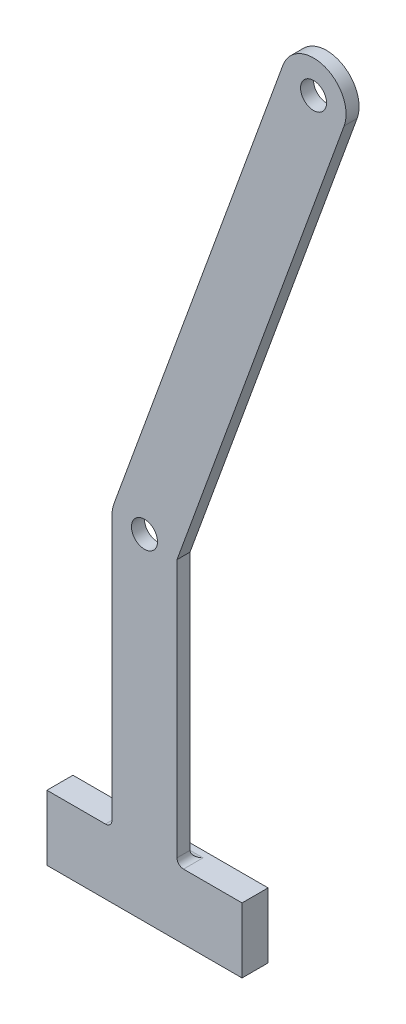
ISO-10303-21;
HEADER;
FILE_DESCRIPTION(('STEP AP214'),'2;1');
FILE_NAME('part.step','',(''),(''),'','','');
FILE_SCHEMA(('AUTOMOTIVE_DESIGN { 1 0 10303 214 1 1 1 1 }'));
ENDSEC;
DATA;
#1=APPLICATION_CONTEXT('core data for automotive mechanical design processes');
#2=APPLICATION_PROTOCOL_DEFINITION('international standard','automotive_design',2000,#1);
#3=PRODUCT_CONTEXT('',#1,'mechanical');
#4=PRODUCT('Part','Part','',(#3));
#5=PRODUCT_RELATED_PRODUCT_CATEGORY('part','',(#4));
#6=PRODUCT_DEFINITION_FORMATION('','',#4);
#7=PRODUCT_DEFINITION_CONTEXT('part definition',#1,'design');
#8=PRODUCT_DEFINITION('design','',#6,#7);
#9=PRODUCT_DEFINITION_SHAPE('','',#8);
#10=(LENGTH_UNIT() NAMED_UNIT(*) SI_UNIT(.MILLI.,.METRE.));
#11=(NAMED_UNIT(*) PLANE_ANGLE_UNIT() SI_UNIT($,.RADIAN.));
#12=(NAMED_UNIT(*) SI_UNIT($,.STERADIAN.) SOLID_ANGLE_UNIT());
#13=UNCERTAINTY_MEASURE_WITH_UNIT(LENGTH_MEASURE(1.E-05),#10,'distance_accuracy_value','');
#14=(GEOMETRIC_REPRESENTATION_CONTEXT(3) GLOBAL_UNCERTAINTY_ASSIGNED_CONTEXT((#13)) GLOBAL_UNIT_ASSIGNED_CONTEXT((#10,
#11,#12)) REPRESENTATION_CONTEXT('',''));
#15=CARTESIAN_POINT('',(0.,0.,0.));
#16=DIRECTION('',(0.,0.,1.));
#17=DIRECTION('',(1.,0.,0.));
#18=AXIS2_PLACEMENT_3D('',#15,#16,#17);
#19=CARTESIAN_POINT('',(0.,0.,0.));
#20=DIRECTION('',(0.,0.,1.));
#21=DIRECTION('',(1.,0.,0.));
#22=AXIS2_PLACEMENT_3D('',#19,#20,#21);
#23=PLANE('',#22);
#24=CARTESIAN_POINT('',(-60.9517842337936,-109.749131758256,0.));
#25=DIRECTION('',(0.,0.,1.));
#26=DIRECTION('',(1.,0.,0.));
#27=AXIS2_PLACEMENT_3D('',#24,#25,#26);
#28=CIRCLE('',#27,2.54);
#29=CARTESIAN_POINT('',(-58.4117842337936,-109.749131758256,0.));
#30=VERTEX_POINT('',#29);
#31=EDGE_CURVE('E175',#30,#30,#28,.T.);
#32=ORIENTED_EDGE('',*,*,#31,.T.);
#33=EDGE_LOOP('',(#32));
#34=FACE_BOUND('',#33,.T.);
#35=CARTESIAN_POINT('',(-27.94,-19.0499999999999,0.));
#36=DIRECTION('',(0.,0.,1.));
#37=DIRECTION('',(1.,0.,0.));
#38=AXIS2_PLACEMENT_3D('',#35,#36,#37);
#39=CIRCLE('',#38,2.54000000000001);
#40=CARTESIAN_POINT('',(-25.4,-19.0499999999999,0.));
#41=VERTEX_POINT('',#40);
#42=EDGE_CURVE('E216',#41,#41,#39,.T.);
#43=ORIENTED_EDGE('',*,*,#42,.T.);
#44=EDGE_LOOP('',(#43));
#45=FACE_BOUND('',#44,.T.);
#46=DIRECTION('',(0.,-1.,0.));
#47=VECTOR('',#46,1.);
#48=CARTESIAN_POINT('',(-54.6017842337937,0.,0.));
#49=LINE('',#48,#47);
#50=CARTESIAN_POINT('',(-54.6017842337936,-110.868808085755,0.));
#51=VERTEX_POINT('',#50);
#52=CARTESIAN_POINT('',(-54.6017842337936,-161.29,0.));
#53=VERTEX_POINT('',#52);
#54=EDGE_CURVE('E208',#51,#53,#49,.T.);
#55=ORIENTED_EDGE('',*,*,#54,.T.);
#56=DIRECTION('',(1.,0.,0.));
#57=VECTOR('',#56,1.);
#58=CARTESIAN_POINT('',(-67.3017842337935,-161.29,0.));
#59=LINE('',#58,#57);
#60=CARTESIAN_POINT('',(-67.3017842337936,-161.29,0.));
#61=VERTEX_POINT('',#60);
#62=EDGE_CURVE('E244',#53,#61,#59,.F.);
#63=ORIENTED_EDGE('',*,*,#62,.T.);
#64=DIRECTION('',(0.,-1.,0.));
#65=VECTOR('',#64,1.);
#66=CARTESIAN_POINT('',(-67.3017842337936,0.,0.));
#67=LINE('',#66,#65);
#68=CARTESIAN_POINT('',(-67.3017842337936,-109.749131758256,0.));
#69=VERTEX_POINT('',#68);
#70=EDGE_CURVE('E206',#69,#61,#67,.T.);
#71=ORIENTED_EDGE('',*,*,#70,.F.);
#72=CARTESIAN_POINT('',(-60.9517842337936,-109.749131758256,0.));
#73=DIRECTION('',(0.,0.,1.));
#74=DIRECTION('',(1.,0.,0.));
#75=AXIS2_PLACEMENT_3D('',#72,#73,#74);
#76=CIRCLE('',#75,6.35);
#77=CARTESIAN_POINT('',(-66.918832375784,-107.577303848138,0.));
#78=VERTEX_POINT('',#77);
#79=EDGE_CURVE('E204',#78,#69,#76,.T.);
#80=ORIENTED_EDGE('',*,*,#79,.F.);
#81=DIRECTION('',(-0.342020143325669,-0.939692620785908,0.));
#82=VECTOR('',#81,1.);
#83=CARTESIAN_POINT('',(-24.5161370300983,8.92314413814722,0.));
#84=LINE('',#83,#82);
#85=CARTESIAN_POINT('',(-33.9070481419905,-16.878172089882,0.));
#86=VERTEX_POINT('',#85);
#87=EDGE_CURVE('E170',#86,#78,#84,.T.);
#88=ORIENTED_EDGE('',*,*,#87,.F.);
#89=CARTESIAN_POINT('',(-27.94,-19.0499999999999,0.));
#90=DIRECTION('',(0.,0.,1.));
#91=DIRECTION('',(1.,0.,0.));
#92=AXIS2_PLACEMENT_3D('',#89,#90,#91);
#93=CIRCLE('',#92,6.35);
#94=CARTESIAN_POINT('',(-21.9729518580095,-21.221827910118,0.));
#95=VERTEX_POINT('',#94);
#96=EDGE_CURVE('E214',#95,#86,#93,.T.);
#97=ORIENTED_EDGE('',*,*,#96,.F.);
#98=DIRECTION('',(-0.342020143325669,-0.939692620785908,0.));
#99=VECTOR('',#98,1.);
#100=CARTESIAN_POINT('',(-12.5820407461173,4.57948831791122,0.));
#101=LINE('',#100,#99);
#102=EDGE_CURVE('E211',#95,#51,#101,.T.);
#103=ORIENTED_EDGE('',*,*,#102,.T.);
#104=EDGE_LOOP('',(#55,#63,#71,#80,#88,#97,#103));
#105=FACE_BOUND('',#104,.T.);
#106=ADVANCED_FACE('F39',(#34,#45,#105),#23,.F.);
#107=CARTESIAN_POINT('',(-24.5161370300983,8.92314413814722,2.54));
#108=DIRECTION('',(0.939692620785908,-0.342020143325669,0.));
#109=DIRECTION('',(0.342020143325669,0.939692620785908,0.));
#110=AXIS2_PLACEMENT_3D('',#107,#108,#109);
#111=PLANE('',#110);
#112=ORIENTED_EDGE('',*,*,#87,.T.);
#113=DIRECTION('',(0.,0.,-1.));
#114=VECTOR('',#113,1.);
#115=CARTESIAN_POINT('',(-66.918832375784,-107.577303848138,2.54));
#116=LINE('',#115,#114);
#117=CARTESIAN_POINT('',(-66.918832375784,-107.577303848138,2.54));
#118=VERTEX_POINT('',#117);
#119=EDGE_CURVE('E234',#118,#78,#116,.T.);
#120=ORIENTED_EDGE('',*,*,#119,.F.);
#121=DIRECTION('',(-0.342020143325669,-0.939692620785908,0.));
#122=VECTOR('',#121,1.);
#123=CARTESIAN_POINT('',(-24.5161370300983,8.92314413814722,2.54));
#124=LINE('',#123,#122);
#125=CARTESIAN_POINT('',(-33.9070481419905,-16.878172089882,2.54));
#126=VERTEX_POINT('',#125);
#127=EDGE_CURVE('E171',#126,#118,#124,.T.);
#128=ORIENTED_EDGE('',*,*,#127,.F.);
#129=DIRECTION('',(0.,0.,-1.));
#130=VECTOR('',#129,1.);
#131=CARTESIAN_POINT('',(-33.9070481419905,-16.878172089882,2.54));
#132=LINE('',#131,#130);
#133=EDGE_CURVE('E201',#126,#86,#132,.T.);
#134=ORIENTED_EDGE('',*,*,#133,.T.);
#135=EDGE_LOOP('',(#112,#120,#128,#134));
#136=FACE_BOUND('',#135,.T.);
#137=ADVANCED_FACE('F290',(#136),#111,.F.);
#138=CARTESIAN_POINT('',(-60.9517842337936,-109.749131758256,2.54));
#139=DIRECTION('',(0.,0.,-1.));
#140=DIRECTION('',(-1.,0.,0.));
#141=AXIS2_PLACEMENT_3D('',#138,#139,#140);
#142=CYLINDRICAL_SURFACE('',#141,6.35);
#143=ORIENTED_EDGE('',*,*,#79,.T.);
#144=DIRECTION('',(0.,0.,-1.));
#145=VECTOR('',#144,1.);
#146=CARTESIAN_POINT('',(-67.3017842337936,-109.749131758256,2.54));
#147=LINE('',#146,#145);
#148=CARTESIAN_POINT('',(-67.3017842337936,-109.749131758256,2.54));
#149=VERTEX_POINT('',#148);
#150=EDGE_CURVE('E231',#149,#69,#147,.T.);
#151=ORIENTED_EDGE('',*,*,#150,.F.);
#152=CARTESIAN_POINT('',(-60.9517842337936,-109.749131758256,2.54));
#153=DIRECTION('',(0.,0.,1.));
#154=DIRECTION('',(1.,0.,0.));
#155=AXIS2_PLACEMENT_3D('',#152,#153,#154);
#156=CIRCLE('',#155,6.35);
#157=EDGE_CURVE('E174',#118,#149,#156,.T.);
#158=ORIENTED_EDGE('',*,*,#157,.F.);
#159=ORIENTED_EDGE('',*,*,#119,.T.);
#160=EDGE_LOOP('',(#143,#151,#158,#159));
#161=FACE_BOUND('',#160,.T.);
#162=ADVANCED_FACE('F291',(#161),#142,.T.);
#163=CARTESIAN_POINT('',(-67.3017842337936,0.,2.54));
#164=DIRECTION('',(1.,0.,0.));
#165=DIRECTION('',(0.,0.,-1.));
#166=AXIS2_PLACEMENT_3D('',#163,#164,#165);
#167=PLANE('',#166);
#168=ORIENTED_EDGE('',*,*,#70,.T.);
#169=DIRECTION('',(0.,0.,-1.));
#170=VECTOR('',#169,1.);
#171=CARTESIAN_POINT('',(-67.3017842337936,-161.29,2.54));
#172=LINE('',#171,#170);
#173=CARTESIAN_POINT('',(-67.3017842337936,-161.29,2.54));
#174=VERTEX_POINT('',#173);
#175=EDGE_CURVE('E56',#61,#174,#172,.F.);
#176=ORIENTED_EDGE('',*,*,#175,.T.);
#177=DIRECTION('',(0.,-1.,0.));
#178=VECTOR('',#177,1.);
#179=CARTESIAN_POINT('',(-67.3017842337936,0.,2.54));
#180=LINE('',#179,#178);
#181=EDGE_CURVE('E177',#149,#174,#180,.T.);
#182=ORIENTED_EDGE('',*,*,#181,.F.);
#183=ORIENTED_EDGE('',*,*,#150,.T.);
#184=EDGE_LOOP('',(#168,#176,#182,#183));
#185=FACE_BOUND('',#184,.T.);
#186=ADVANCED_FACE('F270',(#185),#167,.F.);
#187=CARTESIAN_POINT('',(-80.0017842337936,0.,2.54));
#188=DIRECTION('',(1.,0.,0.));
#189=DIRECTION('',(0.,0.,-1.));
#190=AXIS2_PLACEMENT_3D('',#187,#188,#189);
#191=PLANE('',#190);
#192=DIRECTION('',(0.,0.,-1.));
#193=VECTOR('',#192,1.);
#194=CARTESIAN_POINT('',(-80.0017842337936,-162.56,2.54));
#195=LINE('',#194,#193);
#196=CARTESIAN_POINT('',(-80.0017842337936,-162.56,2.54));
#197=VERTEX_POINT('',#196);
#198=CARTESIAN_POINT('',(-80.0017842337936,-162.56,-2.54));
#199=VERTEX_POINT('',#198);
#200=EDGE_CURVE('E229',#197,#199,#195,.T.);
#201=ORIENTED_EDGE('',*,*,#200,.T.);
#202=DIRECTION('',(0.,1.,0.));
#203=VECTOR('',#202,1.);
#204=CARTESIAN_POINT('',(-80.0017842337936,-162.56,-2.54));
#205=LINE('',#204,#203);
#206=CARTESIAN_POINT('',(-80.0017842337936,-175.26,-2.54));
#207=VERTEX_POINT('',#206);
#208=EDGE_CURVE('E158',#207,#199,#205,.T.);
#209=ORIENTED_EDGE('',*,*,#208,.F.);
#210=DIRECTION('',(0.,0.,-1.));
#211=VECTOR('',#210,1.);
#212=CARTESIAN_POINT('',(-80.0017842337936,-175.26,2.54));
#213=LINE('',#212,#211);
#214=CARTESIAN_POINT('',(-80.0017842337936,-175.26,2.54));
#215=VERTEX_POINT('',#214);
#216=EDGE_CURVE('E148',#215,#207,#213,.T.);
#217=ORIENTED_EDGE('',*,*,#216,.F.);
#218=DIRECTION('',(0.,-1.,0.));
#219=VECTOR('',#218,1.);
#220=CARTESIAN_POINT('',(-80.0017842337936,0.,2.54));
#221=LINE('',#220,#219);
#222=EDGE_CURVE('E181',#197,#215,#221,.T.);
#223=ORIENTED_EDGE('',*,*,#222,.F.);
#224=EDGE_LOOP('',(#201,#209,#217,#223));
#225=FACE_BOUND('',#224,.T.);
#226=ADVANCED_FACE('F299',(#225),#191,.F.);
#227=CARTESIAN_POINT('',(0.,-175.26,2.54));
#228=DIRECTION('',(0.,1.,0.));
#229=DIRECTION('',(0.,0.,1.));
#230=AXIS2_PLACEMENT_3D('',#227,#228,#229);
#231=PLANE('',#230);
#232=ORIENTED_EDGE('',*,*,#216,.T.);
#233=DIRECTION('',(-1.,0.,0.));
#234=VECTOR('',#233,1.);
#235=CARTESIAN_POINT('',(-41.9017842337936,-175.26,-2.54));
#236=LINE('',#235,#234);
#237=CARTESIAN_POINT('',(-41.9017842337936,-175.26,-2.54));
#238=VERTEX_POINT('',#237);
#239=EDGE_CURVE('E152',#238,#207,#236,.T.);
#240=ORIENTED_EDGE('',*,*,#239,.F.);
#241=DIRECTION('',(0.,0.,-1.));
#242=VECTOR('',#241,1.);
#243=CARTESIAN_POINT('',(-41.9017842337936,-175.26,2.54));
#244=LINE('',#243,#242);
#245=CARTESIAN_POINT('',(-41.9017842337936,-175.26,2.54));
#246=VERTEX_POINT('',#245);
#247=EDGE_CURVE('E139',#246,#238,#244,.T.);
#248=ORIENTED_EDGE('',*,*,#247,.F.);
#249=DIRECTION('',(1.,0.,0.));
#250=VECTOR('',#249,1.);
#251=CARTESIAN_POINT('',(0.,-175.26,2.54));
#252=LINE('',#251,#250);
#253=EDGE_CURVE('E183',#215,#246,#252,.T.);
#254=ORIENTED_EDGE('',*,*,#253,.F.);
#255=EDGE_LOOP('',(#232,#240,#248,#254));
#256=FACE_BOUND('',#255,.T.);
#257=ADVANCED_FACE('F153',(#256),#231,.F.);
#258=CARTESIAN_POINT('',(-41.9017842337936,0.,2.54));
#259=DIRECTION('',(-1.,0.,0.));
#260=DIRECTION('',(0.,0.,1.));
#261=AXIS2_PLACEMENT_3D('',#258,#259,#260);
#262=PLANE('',#261);
#263=ORIENTED_EDGE('',*,*,#247,.T.);
#264=DIRECTION('',(0.,-1.,0.));
#265=VECTOR('',#264,1.);
#266=CARTESIAN_POINT('',(-41.9017842337936,-162.56,-2.54));
#267=LINE('',#266,#265);
#268=CARTESIAN_POINT('',(-41.9017842337936,-162.56,-2.54));
#269=VERTEX_POINT('',#268);
#270=EDGE_CURVE('E144',#269,#238,#267,.T.);
#271=ORIENTED_EDGE('',*,*,#270,.F.);
#272=DIRECTION('',(0.,0.,-1.));
#273=VECTOR('',#272,1.);
#274=CARTESIAN_POINT('',(-41.9017842337936,-162.56,2.54));
#275=LINE('',#274,#273);
#276=CARTESIAN_POINT('',(-41.9017842337936,-162.56,2.54));
#277=VERTEX_POINT('',#276);
#278=EDGE_CURVE('E149',#277,#269,#275,.T.);
#279=ORIENTED_EDGE('',*,*,#278,.F.);
#280=DIRECTION('',(0.,1.,0.));
#281=VECTOR('',#280,1.);
#282=CARTESIAN_POINT('',(-41.9017842337936,0.,2.54));
#283=LINE('',#282,#281);
#284=EDGE_CURVE('E145',#246,#277,#283,.T.);
#285=ORIENTED_EDGE('',*,*,#284,.F.);
#286=EDGE_LOOP('',(#263,#271,#279,#285));
#287=FACE_BOUND('',#286,.T.);
#288=ADVANCED_FACE('F141',(#287),#262,.F.);
#289=CARTESIAN_POINT('',(0.,-162.56,2.54));
#290=DIRECTION('',(0.,-1.,0.));
#291=DIRECTION('',(0.,0.,-1.));
#292=AXIS2_PLACEMENT_3D('',#289,#290,#291);
#293=PLANE('',#292);
#294=DIRECTION('',(1.,0.,0.));
#295=VECTOR('',#294,1.);
#296=CARTESIAN_POINT('',(-54.6017842337936,-162.56,-1.27));
#297=LINE('',#296,#295);
#298=CARTESIAN_POINT('',(-68.5717842337936,-162.56,-1.27));
#299=VERTEX_POINT('',#298);
#300=CARTESIAN_POINT('',(-53.3317842337936,-162.56,-1.27));
#301=VERTEX_POINT('',#300);
#302=EDGE_CURVE('E239',#299,#301,#297,.T.);
#303=ORIENTED_EDGE('',*,*,#302,.T.);
#304=DIRECTION('',(0.,0.,-1.));
#305=VECTOR('',#304,1.);
#306=CARTESIAN_POINT('',(-53.3317842337936,-162.56,2.54));
#307=LINE('',#306,#305);
#308=CARTESIAN_POINT('',(-53.3317842337936,-162.56,2.54));
#309=VERTEX_POINT('',#308);
#310=EDGE_CURVE('E242',#301,#309,#307,.F.);
#311=ORIENTED_EDGE('',*,*,#310,.T.);
#312=DIRECTION('',(-1.,0.,0.));
#313=VECTOR('',#312,1.);
#314=CARTESIAN_POINT('',(0.,-162.56,2.54));
#315=LINE('',#314,#313);
#316=EDGE_CURVE('E186',#277,#309,#315,.T.);
#317=ORIENTED_EDGE('',*,*,#316,.F.);
#318=ORIENTED_EDGE('',*,*,#278,.T.);
#319=DIRECTION('',(1.,0.,0.));
#320=VECTOR('',#319,1.);
#321=CARTESIAN_POINT('',(-41.9017842337936,-162.56,-2.54));
#322=LINE('',#321,#320);
#323=EDGE_CURVE('E163',#199,#269,#322,.T.);
#324=ORIENTED_EDGE('',*,*,#323,.F.);
#325=ORIENTED_EDGE('',*,*,#200,.F.);
#326=DIRECTION('',(-1.,0.,0.));
#327=VECTOR('',#326,1.);
#328=CARTESIAN_POINT('',(0.,-162.56,2.54));
#329=LINE('',#328,#327);
#330=CARTESIAN_POINT('',(-68.5717842337936,-162.56,2.54));
#331=VERTEX_POINT('',#330);
#332=EDGE_CURVE('E179',#331,#197,#329,.T.);
#333=ORIENTED_EDGE('',*,*,#332,.F.);
#334=DIRECTION('',(0.,0.,-1.));
#335=VECTOR('',#334,1.);
#336=CARTESIAN_POINT('',(-68.5717842337936,-162.56,0.));
#337=LINE('',#336,#335);
#338=EDGE_CURVE('E237',#331,#299,#337,.T.);
#339=ORIENTED_EDGE('',*,*,#338,.T.);
#340=EDGE_LOOP('',(#303,#311,#317,#318,#324,#325,#333,#339));
#341=FACE_BOUND('',#340,.T.);
#342=ADVANCED_FACE('F260',(#341),#293,.F.);
#343=CARTESIAN_POINT('',(-54.6017842337937,0.,2.54));
#344=DIRECTION('',(1.,0.,0.));
#345=DIRECTION('',(0.,1.,0.));
#346=AXIS2_PLACEMENT_3D('',#343,#344,#345);
#347=PLANE('',#346);
#348=DIRECTION('',(0.,-1.,0.));
#349=VECTOR('',#348,1.);
#350=CARTESIAN_POINT('',(-54.6017842337937,0.,2.54));
#351=LINE('',#350,#349);
#352=CARTESIAN_POINT('',(-54.6017842337936,-110.868808085755,2.54));
#353=VERTEX_POINT('',#352);
#354=CARTESIAN_POINT('',(-54.6017842337936,-161.29,2.54));
#355=VERTEX_POINT('',#354);
#356=EDGE_CURVE('E188',#353,#355,#351,.T.);
#357=ORIENTED_EDGE('',*,*,#356,.T.);
#358=DIRECTION('',(0.,0.,-1.));
#359=VECTOR('',#358,1.);
#360=CARTESIAN_POINT('',(-54.6017842337936,-161.29,2.54));
#361=LINE('',#360,#359);
#362=EDGE_CURVE('E246',#355,#53,#361,.T.);
#363=ORIENTED_EDGE('',*,*,#362,.T.);
#364=ORIENTED_EDGE('',*,*,#54,.F.);
#365=DIRECTION('',(0.,0.,-1.));
#366=VECTOR('',#365,1.);
#367=CARTESIAN_POINT('',(-54.6017842337936,-110.868808085755,2.54));
#368=LINE('',#367,#366);
#369=EDGE_CURVE('E225',#353,#51,#368,.T.);
#370=ORIENTED_EDGE('',*,*,#369,.F.);
#371=EDGE_LOOP('',(#357,#363,#364,#370));
#372=FACE_BOUND('',#371,.T.);
#373=ADVANCED_FACE('F279',(#372),#347,.T.);
#374=CARTESIAN_POINT('',(-12.5820407461173,4.57948831791122,2.54));
#375=DIRECTION('',(0.939692620785908,-0.342020143325669,0.));
#376=DIRECTION('',(0.342020143325669,0.939692620785908,0.));
#377=AXIS2_PLACEMENT_3D('',#374,#375,#376);
#378=PLANE('',#377);
#379=ORIENTED_EDGE('',*,*,#102,.F.);
#380=DIRECTION('',(0.,0.,-1.));
#381=VECTOR('',#380,1.);
#382=CARTESIAN_POINT('',(-21.9729518580095,-21.221827910118,2.54));
#383=LINE('',#382,#381);
#384=CARTESIAN_POINT('',(-21.9729518580095,-21.221827910118,2.54));
#385=VERTEX_POINT('',#384);
#386=EDGE_CURVE('E223',#385,#95,#383,.T.);
#387=ORIENTED_EDGE('',*,*,#386,.F.);
#388=DIRECTION('',(-0.342020143325669,-0.939692620785908,0.));
#389=VECTOR('',#388,1.);
#390=CARTESIAN_POINT('',(-12.5820407461173,4.57948831791122,2.54));
#391=LINE('',#390,#389);
#392=EDGE_CURVE('E190',#385,#353,#391,.T.);
#393=ORIENTED_EDGE('',*,*,#392,.T.);
#394=ORIENTED_EDGE('',*,*,#369,.T.);
#395=EDGE_LOOP('',(#379,#387,#393,#394));
#396=FACE_BOUND('',#395,.T.);
#397=ADVANCED_FACE('F282',(#396),#378,.T.);
#398=CARTESIAN_POINT('',(-27.94,-19.0499999999999,2.54));
#399=DIRECTION('',(0.,0.,-1.));
#400=DIRECTION('',(-1.,0.,0.));
#401=AXIS2_PLACEMENT_3D('',#398,#399,#400);
#402=CYLINDRICAL_SURFACE('',#401,2.54000000000001);
#403=CARTESIAN_POINT('',(-27.94,-19.0499999999999,2.54));
#404=DIRECTION('',(0.,0.,1.));
#405=DIRECTION('',(1.,0.,0.));
#406=AXIS2_PLACEMENT_3D('',#403,#404,#405);
#407=CIRCLE('',#406,2.54000000000001);
#408=CARTESIAN_POINT('',(-25.4,-19.0499999999999,2.54));
#409=VERTEX_POINT('',#408);
#410=EDGE_CURVE('E195',#409,#409,#407,.T.);
#411=ORIENTED_EDGE('',*,*,#410,.T.);
#412=EDGE_LOOP('',(#411));
#413=FACE_BOUND('',#412,.T.);
#414=ORIENTED_EDGE('',*,*,#42,.F.);
#415=EDGE_LOOP('',(#414));
#416=FACE_BOUND('',#415,.T.);
#417=ADVANCED_FACE('F316',(#413,#416),#402,.F.);
#418=CARTESIAN_POINT('',(-27.94,-19.0499999999999,2.54));
#419=DIRECTION('',(0.,0.,-1.));
#420=DIRECTION('',(-1.,0.,0.));
#421=AXIS2_PLACEMENT_3D('',#418,#419,#420);
#422=CYLINDRICAL_SURFACE('',#421,6.35);
#423=ORIENTED_EDGE('',*,*,#96,.T.);
#424=ORIENTED_EDGE('',*,*,#133,.F.);
#425=CARTESIAN_POINT('',(-27.94,-19.0499999999999,2.54));
#426=DIRECTION('',(0.,0.,1.));
#427=DIRECTION('',(1.,0.,0.));
#428=AXIS2_PLACEMENT_3D('',#425,#426,#427);
#429=CIRCLE('',#428,6.35);
#430=EDGE_CURVE('E193',#385,#126,#429,.T.);
#431=ORIENTED_EDGE('',*,*,#430,.F.);
#432=ORIENTED_EDGE('',*,*,#386,.T.);
#433=EDGE_LOOP('',(#423,#424,#431,#432));
#434=FACE_BOUND('',#433,.T.);
#435=ADVANCED_FACE('F286',(#434),#422,.T.);
#436=CARTESIAN_POINT('',(-60.9517842337936,-109.749131758256,2.54));
#437=DIRECTION('',(0.,0.,-1.));
#438=DIRECTION('',(-1.,0.,0.));
#439=AXIS2_PLACEMENT_3D('',#436,#437,#438);
#440=CYLINDRICAL_SURFACE('',#439,2.54);
#441=CARTESIAN_POINT('',(-60.9517842337936,-109.749131758256,2.54));
#442=DIRECTION('',(0.,0.,1.));
#443=DIRECTION('',(1.,0.,0.));
#444=AXIS2_PLACEMENT_3D('',#441,#442,#443);
#445=CIRCLE('',#444,2.54);
#446=CARTESIAN_POINT('',(-58.4117842337936,-109.749131758256,2.54));
#447=VERTEX_POINT('',#446);
#448=EDGE_CURVE('E198',#447,#447,#445,.T.);
#449=ORIENTED_EDGE('',*,*,#448,.T.);
#450=EDGE_LOOP('',(#449));
#451=FACE_BOUND('',#450,.T.);
#452=ORIENTED_EDGE('',*,*,#31,.F.);
#453=EDGE_LOOP('',(#452));
#454=FACE_BOUND('',#453,.T.);
#455=ADVANCED_FACE('F312',(#451,#454),#440,.F.);
#456=CARTESIAN_POINT('',(0.,0.,2.54));
#457=DIRECTION('',(0.,0.,1.));
#458=DIRECTION('',(1.,0.,0.));
#459=AXIS2_PLACEMENT_3D('',#456,#457,#458);
#460=PLANE('',#459);
#461=ORIENTED_EDGE('',*,*,#127,.T.);
#462=ORIENTED_EDGE('',*,*,#157,.T.);
#463=ORIENTED_EDGE('',*,*,#181,.T.);
#464=CARTESIAN_POINT('',(-68.5717842337936,-161.29,2.54));
#465=DIRECTION('',(0.,0.,1.));
#466=DIRECTION('',(1.,0.,0.));
#467=AXIS2_PLACEMENT_3D('',#464,#465,#466);
#468=CIRCLE('',#467,1.27);
#469=EDGE_CURVE('E11',#174,#331,#468,.F.);
#470=ORIENTED_EDGE('',*,*,#469,.T.);
#471=ORIENTED_EDGE('',*,*,#332,.T.);
#472=ORIENTED_EDGE('',*,*,#222,.T.);
#473=ORIENTED_EDGE('',*,*,#253,.T.);
#474=ORIENTED_EDGE('',*,*,#284,.T.);
#475=ORIENTED_EDGE('',*,*,#316,.T.);
#476=CARTESIAN_POINT('',(-53.3317842337936,-161.29,2.54));
#477=DIRECTION('',(0.,0.,1.));
#478=DIRECTION('',(1.,0.,0.));
#479=AXIS2_PLACEMENT_3D('',#476,#477,#478);
#480=CIRCLE('',#479,1.27);
#481=EDGE_CURVE('E48',#309,#355,#480,.F.);
#482=ORIENTED_EDGE('',*,*,#481,.T.);
#483=ORIENTED_EDGE('',*,*,#356,.F.);
#484=ORIENTED_EDGE('',*,*,#392,.F.);
#485=ORIENTED_EDGE('',*,*,#430,.T.);
#486=EDGE_LOOP('',(#461,#462,#463,#470,#471,#472,#473,#474,#475,#482,#483,#484,#485));
#487=FACE_BOUND('',#486,.T.);
#488=ORIENTED_EDGE('',*,*,#410,.F.);
#489=EDGE_LOOP('',(#488));
#490=FACE_BOUND('',#489,.T.);
#491=ORIENTED_EDGE('',*,*,#448,.F.);
#492=EDGE_LOOP('',(#491));
#493=FACE_BOUND('',#492,.T.);
#494=ADVANCED_FACE('F267',(#487,#490,#493),#460,.T.);
#495=CARTESIAN_POINT('',(0.,0.,-2.54));
#496=DIRECTION('',(0.,0.,-1.));
#497=DIRECTION('',(-1.,0.,0.));
#498=AXIS2_PLACEMENT_3D('',#495,#496,#497);
#499=PLANE('',#498);
#500=ORIENTED_EDGE('',*,*,#270,.T.);
#501=ORIENTED_EDGE('',*,*,#239,.T.);
#502=ORIENTED_EDGE('',*,*,#208,.T.);
#503=ORIENTED_EDGE('',*,*,#323,.T.);
#504=EDGE_LOOP('',(#500,#501,#502,#503));
#505=FACE_BOUND('',#504,.T.);
#506=ADVANCED_FACE('F161',(#505),#499,.T.);
#507=CARTESIAN_POINT('',(-68.5717842337936,-161.29,2.54));
#508=DIRECTION('',(0.,0.,1.));
#509=DIRECTION('',(1.,0.,0.));
#510=AXIS2_PLACEMENT_3D('',#507,#508,#509);
#511=CYLINDRICAL_SURFACE('',#510,1.27);
#512=ORIENTED_EDGE('',*,*,#469,.F.);
#513=ORIENTED_EDGE('',*,*,#175,.F.);
#514=CARTESIAN_POINT('',(-68.5717842337936,-161.29,-1.27));
#515=DIRECTION('',(-0.707106781186547,0.,0.707106781186547));
#516=DIRECTION('',(0.707106781186547,0.,0.707106781186547));
#517=AXIS2_PLACEMENT_3D('',#514,#515,#516);
#518=ELLIPSE('',#517,1.79605122421383,1.27);
#519=EDGE_CURVE('E43',#299,#61,#518,.T.);
#520=ORIENTED_EDGE('',*,*,#519,.F.);
#521=ORIENTED_EDGE('',*,*,#338,.F.);
#522=EDGE_LOOP('',(#512,#513,#520,#521));
#523=FACE_BOUND('',#522,.T.);
#524=ADVANCED_FACE('F41',(#523),#511,.F.);
#525=CARTESIAN_POINT('',(-53.3317842337936,-161.29,2.54));
#526=DIRECTION('',(0.,0.,-1.));
#527=DIRECTION('',(-1.,0.,0.));
#528=AXIS2_PLACEMENT_3D('',#525,#526,#527);
#529=CYLINDRICAL_SURFACE('',#528,1.27);
#530=ORIENTED_EDGE('',*,*,#481,.F.);
#531=ORIENTED_EDGE('',*,*,#310,.F.);
#532=CARTESIAN_POINT('',(-53.3317842337936,-161.29,-1.27));
#533=DIRECTION('',(-0.707106781186547,0.,-0.707106781186547));
#534=DIRECTION('',(0.707106781186547,0.,-0.707106781186547));
#535=AXIS2_PLACEMENT_3D('',#532,#533,#534);
#536=ELLIPSE('',#535,1.79605122421383,1.27);
#537=EDGE_CURVE('E166',#53,#301,#536,.F.);
#538=ORIENTED_EDGE('',*,*,#537,.F.);
#539=ORIENTED_EDGE('',*,*,#362,.F.);
#540=EDGE_LOOP('',(#530,#531,#538,#539));
#541=FACE_BOUND('',#540,.T.);
#542=ADVANCED_FACE('F257',(#541),#529,.F.);
#543=CARTESIAN_POINT('',(0.,-161.29,-1.27));
#544=DIRECTION('',(-1.,0.,0.));
#545=DIRECTION('',(0.,0.,1.));
#546=AXIS2_PLACEMENT_3D('',#543,#544,#545);
#547=CYLINDRICAL_SURFACE('',#546,1.27);
#548=ORIENTED_EDGE('',*,*,#519,.T.);
#549=ORIENTED_EDGE('',*,*,#62,.F.);
#550=ORIENTED_EDGE('',*,*,#537,.T.);
#551=ORIENTED_EDGE('',*,*,#302,.F.);
#552=EDGE_LOOP('',(#548,#549,#550,#551));
#553=FACE_BOUND('',#552,.T.);
#554=ADVANCED_FACE('F254',(#553),#547,.F.);
#555=CLOSED_SHELL('',(#106,#137,#162,#186,#226,#257,#288,#342,#373,#397,#417,#435,#455,#494,
#506,#524,#542,#554));
#556=MANIFOLD_SOLID_BREP('B2',#555);
#557=ADVANCED_BREP_SHAPE_REPRESENTATION('',(#18,#556),#14);
#558=SHAPE_DEFINITION_REPRESENTATION(#9,#557);
ENDSEC;
END-ISO-10303-21;
